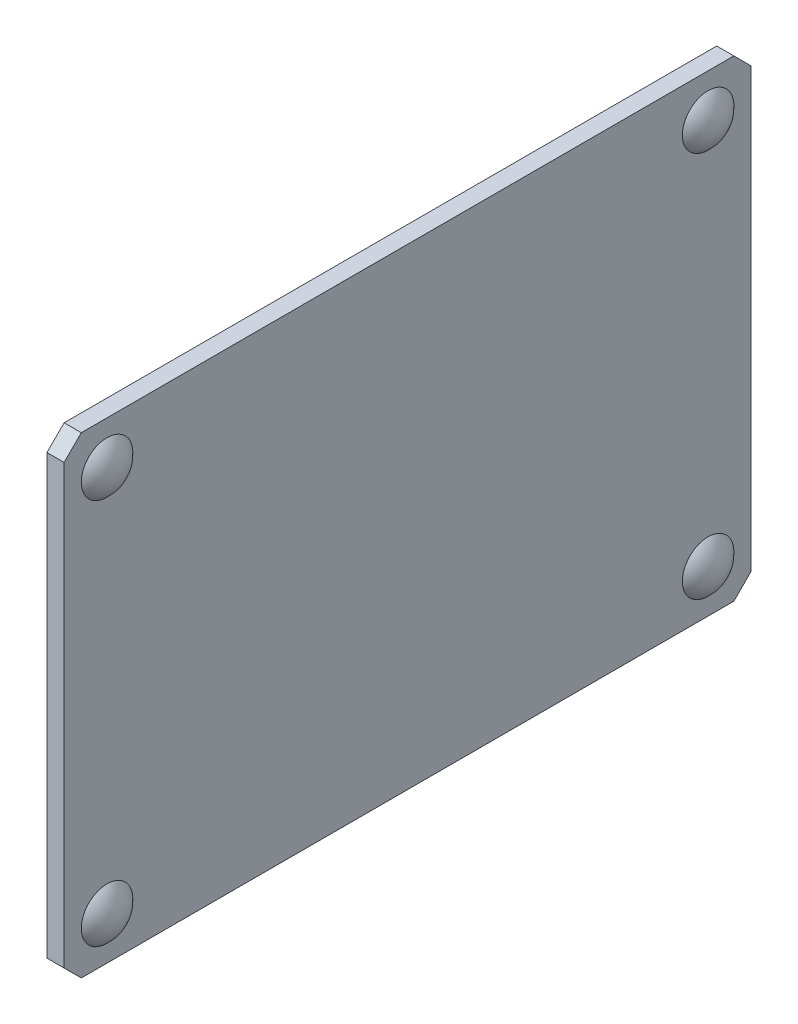
ISO-10303-21;
HEADER;
FILE_DESCRIPTION(('STEP AP214'),'2;1');
FILE_NAME('part.step','',(''),(''),'','','');
FILE_SCHEMA(('AUTOMOTIVE_DESIGN { 1 0 10303 214 1 1 1 1 }'));
ENDSEC;
DATA;
#1=APPLICATION_CONTEXT('core data for automotive mechanical design processes');
#2=APPLICATION_PROTOCOL_DEFINITION('international standard','automotive_design',2000,#1);
#3=PRODUCT_CONTEXT('',#1,'mechanical');
#4=PRODUCT('Part','Part','',(#3));
#5=PRODUCT_RELATED_PRODUCT_CATEGORY('part','',(#4));
#6=PRODUCT_DEFINITION_FORMATION('','',#4);
#7=PRODUCT_DEFINITION_CONTEXT('part definition',#1,'design');
#8=PRODUCT_DEFINITION('design','',#6,#7);
#9=PRODUCT_DEFINITION_SHAPE('','',#8);
#10=(LENGTH_UNIT() NAMED_UNIT(*) SI_UNIT(.MILLI.,.METRE.));
#11=(NAMED_UNIT(*) PLANE_ANGLE_UNIT() SI_UNIT($,.RADIAN.));
#12=(NAMED_UNIT(*) SI_UNIT($,.STERADIAN.) SOLID_ANGLE_UNIT());
#13=UNCERTAINTY_MEASURE_WITH_UNIT(LENGTH_MEASURE(1.E-05),#10,'distance_accuracy_value','');
#14=(GEOMETRIC_REPRESENTATION_CONTEXT(3) GLOBAL_UNCERTAINTY_ASSIGNED_CONTEXT((#13)) GLOBAL_UNIT_ASSIGNED_CONTEXT((#10,
#11,#12)) REPRESENTATION_CONTEXT('',''));
#15=CARTESIAN_POINT('',(0.,0.,0.));
#16=DIRECTION('',(0.,0.,1.));
#17=DIRECTION('',(1.,0.,0.));
#18=AXIS2_PLACEMENT_3D('',#15,#16,#17);
#19=CARTESIAN_POINT('',(2.,-25.5,40.));
#20=DIRECTION('',(0.,0.,1.));
#21=DIRECTION('',(0.,1.,0.));
#22=AXIS2_PLACEMENT_3D('',#19,#20,#21);
#23=PLANE('',#22);
#24=DIRECTION('',(0.,-1.,0.));
#25=VECTOR('',#24,1.);
#26=CARTESIAN_POINT('',(0.,25.5,40.));
#27=LINE('',#26,#25);
#28=CARTESIAN_POINT('',(0.,25.5,40.));
#29=VERTEX_POINT('',#28);
#30=CARTESIAN_POINT('',(0.,-25.5,40.));
#31=VERTEX_POINT('',#30);
#32=EDGE_CURVE('E83',#29,#31,#27,.T.);
#33=ORIENTED_EDGE('',*,*,#32,.T.);
#34=DIRECTION('',(1.,0.,0.));
#35=VECTOR('',#34,1.);
#36=CARTESIAN_POINT('',(0.,-25.5,40.));
#37=LINE('',#36,#35);
#38=CARTESIAN_POINT('',(2.,-25.5,40.));
#39=VERTEX_POINT('',#38);
#40=EDGE_CURVE('E97',#39,#31,#37,.F.);
#41=ORIENTED_EDGE('',*,*,#40,.F.);
#42=DIRECTION('',(0.,1.,0.));
#43=VECTOR('',#42,1.);
#44=CARTESIAN_POINT('',(2.,-25.5,40.));
#45=LINE('',#44,#43);
#46=CARTESIAN_POINT('',(2.,25.5,40.));
#47=VERTEX_POINT('',#46);
#48=EDGE_CURVE('E103',#47,#39,#45,.F.);
#49=ORIENTED_EDGE('',*,*,#48,.F.);
#50=DIRECTION('',(-1.,0.,0.));
#51=VECTOR('',#50,1.);
#52=CARTESIAN_POINT('',(2.,25.5,40.));
#53=LINE('',#52,#51);
#54=EDGE_CURVE('E91',#47,#29,#53,.T.);
#55=ORIENTED_EDGE('',*,*,#54,.T.);
#56=EDGE_LOOP('',(#33,#41,#49,#55));
#57=FACE_BOUND('',#56,.T.);
#58=ADVANCED_FACE('F17',(#57),#23,.T.);
#59=CARTESIAN_POINT('',(0.,-27.5,38.));
#60=DIRECTION('',(0.,-0.707106781186548,0.707106781186547));
#61=DIRECTION('',(1.,0.,0.));
#62=AXIS2_PLACEMENT_3D('',#59,#60,#61);
#63=PLANE('',#62);
#64=DIRECTION('',(0.,-0.707106781186548,-0.707106781186548));
#65=VECTOR('',#64,1.);
#66=CARTESIAN_POINT('',(0.,-25.5,40.));
#67=LINE('',#66,#65);
#68=CARTESIAN_POINT('',(0.,-27.5,38.));
#69=VERTEX_POINT('',#68);
#70=EDGE_CURVE('E80',#31,#69,#67,.T.);
#71=ORIENTED_EDGE('',*,*,#70,.T.);
#72=DIRECTION('',(1.,0.,0.));
#73=VECTOR('',#72,1.);
#74=CARTESIAN_POINT('',(0.,-27.5,38.));
#75=LINE('',#74,#73);
#76=CARTESIAN_POINT('',(2.,-27.5,38.));
#77=VERTEX_POINT('',#76);
#78=EDGE_CURVE('E90',#77,#69,#75,.F.);
#79=ORIENTED_EDGE('',*,*,#78,.F.);
#80=DIRECTION('',(0.,0.707106781186548,0.707106781186548));
#81=VECTOR('',#80,1.);
#82=CARTESIAN_POINT('',(2.,-27.5,38.));
#83=LINE('',#82,#81);
#84=EDGE_CURVE('E102',#39,#77,#83,.F.);
#85=ORIENTED_EDGE('',*,*,#84,.F.);
#86=ORIENTED_EDGE('',*,*,#40,.T.);
#87=EDGE_LOOP('',(#71,#79,#85,#86));
#88=FACE_BOUND('',#87,.T.);
#89=ADVANCED_FACE('F101',(#88),#63,.T.);
#90=CARTESIAN_POINT('',(0.,-27.5,-38.));
#91=DIRECTION('',(0.,-1.,0.));
#92=DIRECTION('',(1.,0.,0.));
#93=AXIS2_PLACEMENT_3D('',#90,#91,#92);
#94=PLANE('',#93);
#95=DIRECTION('',(0.,0.,-1.));
#96=VECTOR('',#95,1.);
#97=CARTESIAN_POINT('',(0.,-27.5,38.));
#98=LINE('',#97,#96);
#99=CARTESIAN_POINT('',(0.,-27.5,-38.));
#100=VERTEX_POINT('',#99);
#101=EDGE_CURVE('E85',#69,#100,#98,.T.);
#102=ORIENTED_EDGE('',*,*,#101,.T.);
#103=DIRECTION('',(1.,0.,0.));
#104=VECTOR('',#103,1.);
#105=CARTESIAN_POINT('',(0.,-27.5,-38.));
#106=LINE('',#105,#104);
#107=CARTESIAN_POINT('',(2.,-27.5,-38.));
#108=VERTEX_POINT('',#107);
#109=EDGE_CURVE('E125',#108,#100,#106,.F.);
#110=ORIENTED_EDGE('',*,*,#109,.F.);
#111=DIRECTION('',(0.,0.,1.));
#112=VECTOR('',#111,1.);
#113=CARTESIAN_POINT('',(2.,-27.5,-38.));
#114=LINE('',#113,#112);
#115=EDGE_CURVE('E130',#77,#108,#114,.F.);
#116=ORIENTED_EDGE('',*,*,#115,.F.);
#117=ORIENTED_EDGE('',*,*,#78,.T.);
#118=EDGE_LOOP('',(#102,#110,#116,#117));
#119=FACE_BOUND('',#118,.T.);
#120=ADVANCED_FACE('F227',(#119),#94,.T.);
#121=CARTESIAN_POINT('',(0.,-25.5,-40.));
#122=DIRECTION('',(0.,-0.707106781186548,-0.707106781186547));
#123=DIRECTION('',(1.,0.,0.));
#124=AXIS2_PLACEMENT_3D('',#121,#122,#123);
#125=PLANE('',#124);
#126=DIRECTION('',(0.,0.707106781186548,-0.707106781186548));
#127=VECTOR('',#126,1.);
#128=CARTESIAN_POINT('',(0.,-27.5,-38.));
#129=LINE('',#128,#127);
#130=CARTESIAN_POINT('',(0.,-25.5,-40.));
#131=VERTEX_POINT('',#130);
#132=EDGE_CURVE('E134',#100,#131,#129,.T.);
#133=ORIENTED_EDGE('',*,*,#132,.T.);
#134=DIRECTION('',(1.,0.,0.));
#135=VECTOR('',#134,1.);
#136=CARTESIAN_POINT('',(0.,-25.5,-40.));
#137=LINE('',#136,#135);
#138=CARTESIAN_POINT('',(2.,-25.5,-40.));
#139=VERTEX_POINT('',#138);
#140=EDGE_CURVE('E139',#139,#131,#137,.F.);
#141=ORIENTED_EDGE('',*,*,#140,.F.);
#142=DIRECTION('',(0.,-0.707106781186548,0.707106781186548));
#143=VECTOR('',#142,1.);
#144=CARTESIAN_POINT('',(2.,-25.5,-40.));
#145=LINE('',#144,#143);
#146=EDGE_CURVE('E144',#108,#139,#145,.F.);
#147=ORIENTED_EDGE('',*,*,#146,.F.);
#148=ORIENTED_EDGE('',*,*,#109,.T.);
#149=EDGE_LOOP('',(#133,#141,#147,#148));
#150=FACE_BOUND('',#149,.T.);
#151=ADVANCED_FACE('F232',(#150),#125,.T.);
#152=CARTESIAN_POINT('',(0.,-25.5,-40.));
#153=DIRECTION('',(0.,0.,-1.));
#154=DIRECTION('',(0.,1.,0.));
#155=AXIS2_PLACEMENT_3D('',#152,#153,#154);
#156=PLANE('',#155);
#157=DIRECTION('',(0.,1.,0.));
#158=VECTOR('',#157,1.);
#159=CARTESIAN_POINT('',(0.,-25.5,-40.));
#160=LINE('',#159,#158);
#161=CARTESIAN_POINT('',(0.,25.5,-40.));
#162=VERTEX_POINT('',#161);
#163=EDGE_CURVE('E148',#131,#162,#160,.T.);
#164=ORIENTED_EDGE('',*,*,#163,.T.);
#165=DIRECTION('',(1.,0.,0.));
#166=VECTOR('',#165,1.);
#167=CARTESIAN_POINT('',(0.,25.5,-40.));
#168=LINE('',#167,#166);
#169=CARTESIAN_POINT('',(2.,25.5,-40.));
#170=VERTEX_POINT('',#169);
#171=EDGE_CURVE('E153',#170,#162,#168,.F.);
#172=ORIENTED_EDGE('',*,*,#171,.F.);
#173=DIRECTION('',(0.,-1.,0.));
#174=VECTOR('',#173,1.);
#175=CARTESIAN_POINT('',(2.,25.5,-40.));
#176=LINE('',#175,#174);
#177=EDGE_CURVE('E158',#139,#170,#176,.F.);
#178=ORIENTED_EDGE('',*,*,#177,.F.);
#179=ORIENTED_EDGE('',*,*,#140,.T.);
#180=EDGE_LOOP('',(#164,#172,#178,#179));
#181=FACE_BOUND('',#180,.T.);
#182=ADVANCED_FACE('F236',(#181),#156,.T.);
#183=CARTESIAN_POINT('',(0.,27.5,-38.));
#184=DIRECTION('',(0.,0.707106781186548,-0.707106781186547));
#185=DIRECTION('',(1.,0.,0.));
#186=AXIS2_PLACEMENT_3D('',#183,#184,#185);
#187=PLANE('',#186);
#188=DIRECTION('',(0.,0.707106781186548,0.707106781186548));
#189=VECTOR('',#188,1.);
#190=CARTESIAN_POINT('',(0.,25.5,-40.));
#191=LINE('',#190,#189);
#192=CARTESIAN_POINT('',(0.,27.5,-38.));
#193=VERTEX_POINT('',#192);
#194=EDGE_CURVE('E162',#162,#193,#191,.T.);
#195=ORIENTED_EDGE('',*,*,#194,.T.);
#196=DIRECTION('',(1.,0.,0.));
#197=VECTOR('',#196,1.);
#198=CARTESIAN_POINT('',(0.,27.5,-38.));
#199=LINE('',#198,#197);
#200=CARTESIAN_POINT('',(2.,27.5,-38.));
#201=VERTEX_POINT('',#200);
#202=EDGE_CURVE('E167',#201,#193,#199,.F.);
#203=ORIENTED_EDGE('',*,*,#202,.F.);
#204=DIRECTION('',(0.,-0.707106781186548,-0.707106781186548));
#205=VECTOR('',#204,1.);
#206=CARTESIAN_POINT('',(2.,27.5,-38.));
#207=LINE('',#206,#205);
#208=EDGE_CURVE('E172',#170,#201,#207,.F.);
#209=ORIENTED_EDGE('',*,*,#208,.F.);
#210=ORIENTED_EDGE('',*,*,#171,.T.);
#211=EDGE_LOOP('',(#195,#203,#209,#210));
#212=FACE_BOUND('',#211,.T.);
#213=ADVANCED_FACE('F240',(#212),#187,.T.);
#214=CARTESIAN_POINT('',(0.,27.5,38.));
#215=DIRECTION('',(0.,1.,0.));
#216=DIRECTION('',(1.,0.,0.));
#217=AXIS2_PLACEMENT_3D('',#214,#215,#216);
#218=PLANE('',#217);
#219=DIRECTION('',(0.,0.,1.));
#220=VECTOR('',#219,1.);
#221=CARTESIAN_POINT('',(0.,27.5,-38.));
#222=LINE('',#221,#220);
#223=CARTESIAN_POINT('',(0.,27.5,38.));
#224=VERTEX_POINT('',#223);
#225=EDGE_CURVE('E176',#193,#224,#222,.T.);
#226=ORIENTED_EDGE('',*,*,#225,.T.);
#227=DIRECTION('',(1.,0.,0.));
#228=VECTOR('',#227,1.);
#229=CARTESIAN_POINT('',(0.,27.5,38.));
#230=LINE('',#229,#228);
#231=CARTESIAN_POINT('',(2.,27.5,38.));
#232=VERTEX_POINT('',#231);
#233=EDGE_CURVE('E180',#232,#224,#230,.F.);
#234=ORIENTED_EDGE('',*,*,#233,.F.);
#235=DIRECTION('',(0.,0.,-1.));
#236=VECTOR('',#235,1.);
#237=CARTESIAN_POINT('',(2.,27.5,38.));
#238=LINE('',#237,#236);
#239=EDGE_CURVE('E32',#201,#232,#238,.F.);
#240=ORIENTED_EDGE('',*,*,#239,.F.);
#241=ORIENTED_EDGE('',*,*,#202,.T.);
#242=EDGE_LOOP('',(#226,#234,#240,#241));
#243=FACE_BOUND('',#242,.T.);
#244=ADVANCED_FACE('F244',(#243),#218,.T.);
#245=CARTESIAN_POINT('',(0.,25.5,40.));
#246=DIRECTION('',(0.,0.707106781186548,0.707106781186547));
#247=DIRECTION('',(1.,0.,0.));
#248=AXIS2_PLACEMENT_3D('',#245,#246,#247);
#249=PLANE('',#248);
#250=DIRECTION('',(0.,-0.707106781186548,0.707106781186548));
#251=VECTOR('',#250,1.);
#252=CARTESIAN_POINT('',(0.,27.5,38.));
#253=LINE('',#252,#251);
#254=EDGE_CURVE('E40',#224,#29,#253,.T.);
#255=ORIENTED_EDGE('',*,*,#254,.T.);
#256=ORIENTED_EDGE('',*,*,#54,.F.);
#257=DIRECTION('',(0.,0.707106781186548,-0.707106781186548));
#258=VECTOR('',#257,1.);
#259=CARTESIAN_POINT('',(2.,25.5,40.));
#260=LINE('',#259,#258);
#261=EDGE_CURVE('E191',#232,#47,#260,.F.);
#262=ORIENTED_EDGE('',*,*,#261,.F.);
#263=ORIENTED_EDGE('',*,*,#233,.T.);
#264=EDGE_LOOP('',(#255,#256,#262,#263));
#265=FACE_BOUND('',#264,.T.);
#266=ADVANCED_FACE('F210',(#265),#249,.T.);
#267=CARTESIAN_POINT('',(2.,-27.5,40.));
#268=DIRECTION('',(1.,0.,0.));
#269=DIRECTION('',(0.,0.,-1.));
#270=AXIS2_PLACEMENT_3D('',#267,#268,#269);
#271=PLANE('',#270);
#272=ORIENTED_EDGE('',*,*,#48,.T.);
#273=ORIENTED_EDGE('',*,*,#84,.T.);
#274=ORIENTED_EDGE('',*,*,#115,.T.);
#275=ORIENTED_EDGE('',*,*,#146,.T.);
#276=ORIENTED_EDGE('',*,*,#177,.T.);
#277=ORIENTED_EDGE('',*,*,#208,.T.);
#278=ORIENTED_EDGE('',*,*,#239,.T.);
#279=ORIENTED_EDGE('',*,*,#261,.T.);
#280=EDGE_LOOP('',(#272,#273,#274,#275,#276,#277,#278,#279));
#281=FACE_BOUND('',#280,.T.);
#282=CARTESIAN_POINT('',(2.,-22.4999999999992,-35.));
#283=DIRECTION('',(-1.,0.,0.));
#284=DIRECTION('',(0.,-1.,0.));
#285=AXIS2_PLACEMENT_3D('',#282,#283,#284);
#286=CIRCLE('',#285,2.99999999999919);
#287=CARTESIAN_POINT('',(2.,-25.4999999999984,-35.));
#288=VERTEX_POINT('',#287);
#289=EDGE_CURVE('E195',#288,#288,#286,.F.);
#290=ORIENTED_EDGE('',*,*,#289,.F.);
#291=EDGE_LOOP('',(#290));
#292=FACE_BOUND('',#291,.T.);
#293=CARTESIAN_POINT('',(2.,22.5000000000008,35.));
#294=DIRECTION('',(-1.,0.,0.));
#295=DIRECTION('',(0.,-1.,0.));
#296=AXIS2_PLACEMENT_3D('',#293,#294,#295);
#297=CIRCLE('',#296,2.99999999999919);
#298=CARTESIAN_POINT('',(2.,19.5000000000016,35.));
#299=VERTEX_POINT('',#298);
#300=EDGE_CURVE('E200',#299,#299,#297,.F.);
#301=ORIENTED_EDGE('',*,*,#300,.F.);
#302=EDGE_LOOP('',(#301));
#303=FACE_BOUND('',#302,.T.);
#304=CARTESIAN_POINT('',(2.,-22.4999999999992,35.));
#305=DIRECTION('',(-1.,0.,0.));
#306=DIRECTION('',(0.,-1.,0.));
#307=AXIS2_PLACEMENT_3D('',#304,#305,#306);
#308=CIRCLE('',#307,2.99999999999919);
#309=CARTESIAN_POINT('',(2.,-25.4999999999984,35.));
#310=VERTEX_POINT('',#309);
#311=EDGE_CURVE('E25',#310,#310,#308,.F.);
#312=ORIENTED_EDGE('',*,*,#311,.F.);
#313=EDGE_LOOP('',(#312));
#314=FACE_BOUND('',#313,.T.);
#315=CARTESIAN_POINT('',(2.,22.5000000000008,-35.));
#316=DIRECTION('',(-1.,0.,0.));
#317=DIRECTION('',(0.,-1.,0.));
#318=AXIS2_PLACEMENT_3D('',#315,#316,#317);
#319=CIRCLE('',#318,2.99999999999919);
#320=CARTESIAN_POINT('',(2.,19.5000000000016,-35.));
#321=VERTEX_POINT('',#320);
#322=EDGE_CURVE('E11',#321,#321,#319,.F.);
#323=ORIENTED_EDGE('',*,*,#322,.F.);
#324=EDGE_LOOP('',(#323));
#325=FACE_BOUND('',#324,.T.);
#326=ADVANCED_FACE('F207',(#281,#292,#303,#314,#325),#271,.T.);
#327=CARTESIAN_POINT('',(0.,-27.5,40.));
#328=DIRECTION('',(-1.,0.,0.));
#329=DIRECTION('',(0.,1.,0.));
#330=AXIS2_PLACEMENT_3D('',#327,#328,#329);
#331=PLANE('',#330);
#332=ORIENTED_EDGE('',*,*,#32,.F.);
#333=ORIENTED_EDGE('',*,*,#254,.F.);
#334=ORIENTED_EDGE('',*,*,#225,.F.);
#335=ORIENTED_EDGE('',*,*,#194,.F.);
#336=ORIENTED_EDGE('',*,*,#163,.F.);
#337=ORIENTED_EDGE('',*,*,#132,.F.);
#338=ORIENTED_EDGE('',*,*,#101,.F.);
#339=ORIENTED_EDGE('',*,*,#70,.F.);
#340=EDGE_LOOP('',(#332,#333,#334,#335,#336,#337,#338,#339));
#341=FACE_BOUND('',#340,.T.);
#342=ADVANCED_FACE('F82',(#341),#331,.T.);
#343=CARTESIAN_POINT('',(-0.645751311062818,-22.4999999999992,35.));
#344=DIRECTION('',(1.,0.,0.));
#345=DIRECTION('',(0.,1.,0.));
#346=AXIS2_PLACEMENT_3D('',#343,#344,#345);
#347=SPHERICAL_SURFACE('',#346,3.99999999999822);
#348=ORIENTED_EDGE('',*,*,#311,.T.);
#349=EDGE_LOOP('',(#348));
#350=FACE_BOUND('',#349,.T.);
#351=ADVANCED_FACE('F205',(#350),#347,.T.);
#352=CARTESIAN_POINT('',(-0.645751311062815,22.5000000000008,35.));
#353=DIRECTION('',(1.,0.,0.));
#354=DIRECTION('',(0.,1.,0.));
#355=AXIS2_PLACEMENT_3D('',#352,#353,#354);
#356=SPHERICAL_SURFACE('',#355,3.99999999999822);
#357=ORIENTED_EDGE('',*,*,#300,.T.);
#358=EDGE_LOOP('',(#357));
#359=FACE_BOUND('',#358,.T.);
#360=ADVANCED_FACE('F220',(#359),#356,.T.);
#361=CARTESIAN_POINT('',(-0.645751311062818,-22.4999999999992,-35.));
#362=DIRECTION('',(1.,0.,0.));
#363=DIRECTION('',(0.,1.,0.));
#364=AXIS2_PLACEMENT_3D('',#361,#362,#363);
#365=SPHERICAL_SURFACE('',#364,3.99999999999822);
#366=ORIENTED_EDGE('',*,*,#289,.T.);
#367=EDGE_LOOP('',(#366));
#368=FACE_BOUND('',#367,.T.);
#369=ADVANCED_FACE('F215',(#368),#365,.T.);
#370=CARTESIAN_POINT('',(-0.645751311062815,22.5000000000008,-35.));
#371=DIRECTION('',(1.,0.,0.));
#372=DIRECTION('',(0.,1.,0.));
#373=AXIS2_PLACEMENT_3D('',#370,#371,#372);
#374=SPHERICAL_SURFACE('',#373,3.99999999999822);
#375=ORIENTED_EDGE('',*,*,#322,.T.);
#376=EDGE_LOOP('',(#375));
#377=FACE_BOUND('',#376,.T.);
#378=ADVANCED_FACE('F19',(#377),#374,.T.);
#379=CLOSED_SHELL('',(#58,#89,#120,#151,#182,#213,#244,#266,#326,#342,#351,#360,#369,#378));
#380=MANIFOLD_SOLID_BREP('B1',#379);
#381=ADVANCED_BREP_SHAPE_REPRESENTATION('',(#18,#380),#14);
#382=SHAPE_DEFINITION_REPRESENTATION(#9,#381);
ENDSEC;
END-ISO-10303-21;
